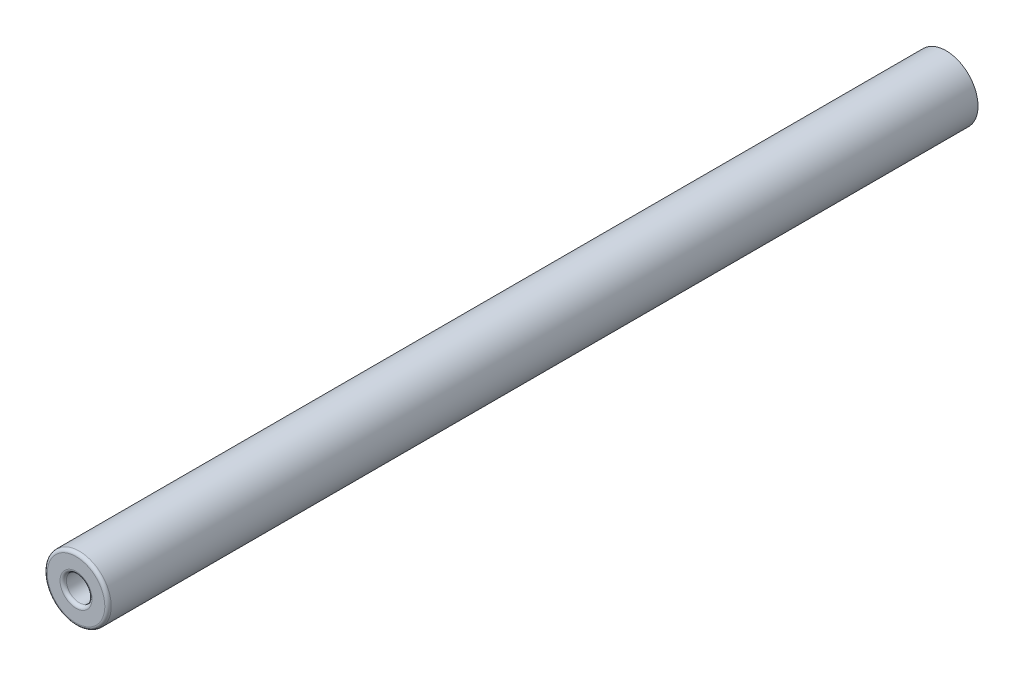
ISO-10303-21;
HEADER;
FILE_DESCRIPTION(('STEP AP214'),'2;1');
FILE_NAME('part.step','',(''),(''),'','','');
FILE_SCHEMA(('AUTOMOTIVE_DESIGN { 1 0 10303 214 1 1 1 1 }'));
ENDSEC;
DATA;
#1=APPLICATION_CONTEXT('core data for automotive mechanical design processes');
#2=APPLICATION_PROTOCOL_DEFINITION('international standard','automotive_design',2000,#1);
#3=PRODUCT_CONTEXT('',#1,'mechanical');
#4=PRODUCT('Part','Part','',(#3));
#5=PRODUCT_RELATED_PRODUCT_CATEGORY('part','',(#4));
#6=PRODUCT_DEFINITION_FORMATION('','',#4);
#7=PRODUCT_DEFINITION_CONTEXT('part definition',#1,'design');
#8=PRODUCT_DEFINITION('design','',#6,#7);
#9=PRODUCT_DEFINITION_SHAPE('','',#8);
#10=(LENGTH_UNIT() NAMED_UNIT(*) SI_UNIT(.MILLI.,.METRE.));
#11=(NAMED_UNIT(*) PLANE_ANGLE_UNIT() SI_UNIT($,.RADIAN.));
#12=(NAMED_UNIT(*) SI_UNIT($,.STERADIAN.) SOLID_ANGLE_UNIT());
#13=UNCERTAINTY_MEASURE_WITH_UNIT(LENGTH_MEASURE(1.E-05),#10,'distance_accuracy_value','');
#14=(GEOMETRIC_REPRESENTATION_CONTEXT(3) GLOBAL_UNCERTAINTY_ASSIGNED_CONTEXT((#13)) GLOBAL_UNIT_ASSIGNED_CONTEXT((#10,
#11,#12)) REPRESENTATION_CONTEXT('',''));
#15=CARTESIAN_POINT('',(0.,0.,0.));
#16=DIRECTION('',(0.,0.,1.));
#17=DIRECTION('',(1.,0.,0.));
#18=AXIS2_PLACEMENT_3D('',#15,#16,#17);
#19=CARTESIAN_POINT('',(0.,0.,34.));
#20=DIRECTION('',(0.,0.,-1.));
#21=DIRECTION('',(-1.,0.,0.));
#22=AXIS2_PLACEMENT_3D('',#19,#20,#21);
#23=CYLINDRICAL_SURFACE('',#22,2.5);
#24=CARTESIAN_POINT('',(0.,0.,33.75));
#25=DIRECTION('',(0.,0.,1.));
#26=DIRECTION('',(1.,0.,0.));
#27=AXIS2_PLACEMENT_3D('',#24,#25,#26);
#28=CIRCLE('',#27,2.5);
#29=CARTESIAN_POINT('',(2.5,0.,33.75));
#30=VERTEX_POINT('',#29);
#31=EDGE_CURVE('E49',#30,#30,#28,.F.);
#32=ORIENTED_EDGE('',*,*,#31,.T.);
#33=EDGE_LOOP('',(#32));
#34=FACE_BOUND('',#33,.T.);
#35=CARTESIAN_POINT('',(0.,0.,-34.));
#36=DIRECTION('',(0.,0.,1.));
#37=DIRECTION('',(1.,0.,0.));
#38=AXIS2_PLACEMENT_3D('',#35,#36,#37);
#39=CIRCLE('',#38,2.5);
#40=CARTESIAN_POINT('',(2.5,0.,-34.));
#41=VERTEX_POINT('',#40);
#42=EDGE_CURVE('E62',#41,#41,#39,.T.);
#43=ORIENTED_EDGE('',*,*,#42,.T.);
#44=EDGE_LOOP('',(#43));
#45=FACE_BOUND('',#44,.T.);
#46=ADVANCED_FACE('F42',(#34,#45),#23,.T.);
#47=CARTESIAN_POINT('',(0.,0.,34.));
#48=DIRECTION('',(0.,0.,1.));
#49=DIRECTION('',(1.,0.,0.));
#50=AXIS2_PLACEMENT_3D('',#47,#48,#49);
#51=PLANE('',#50);
#52=CARTESIAN_POINT('',(0.,0.,34.));
#53=DIRECTION('',(0.,0.,1.));
#54=DIRECTION('',(1.,0.,0.));
#55=AXIS2_PLACEMENT_3D('',#52,#53,#54);
#56=CIRCLE('',#55,2.25);
#57=CARTESIAN_POINT('',(2.25,0.,34.));
#58=VERTEX_POINT('',#57);
#59=EDGE_CURVE('E53',#58,#58,#56,.T.);
#60=ORIENTED_EDGE('',*,*,#59,.T.);
#61=EDGE_LOOP('',(#60));
#62=FACE_BOUND('',#61,.T.);
#63=CARTESIAN_POINT('',(0.,0.,34.));
#64=DIRECTION('',(0.,0.,1.));
#65=DIRECTION('',(1.,0.,0.));
#66=AXIS2_PLACEMENT_3D('',#63,#64,#65);
#67=CIRCLE('',#66,1.25);
#68=CARTESIAN_POINT('',(1.25,0.,34.));
#69=VERTEX_POINT('',#68);
#70=EDGE_CURVE('E57',#69,#69,#67,.F.);
#71=ORIENTED_EDGE('',*,*,#70,.T.);
#72=EDGE_LOOP('',(#71));
#73=FACE_BOUND('',#72,.T.);
#74=ADVANCED_FACE('F81',(#62,#73),#51,.T.);
#75=CARTESIAN_POINT('',(0.,0.,-34.));
#76=DIRECTION('',(0.,0.,1.));
#77=DIRECTION('',(1.,0.,0.));
#78=AXIS2_PLACEMENT_3D('',#75,#76,#77);
#79=PLANE('',#78);
#80=ORIENTED_EDGE('',*,*,#42,.F.);
#81=EDGE_LOOP('',(#80));
#82=FACE_BOUND('',#81,.T.);
#83=ADVANCED_FACE('F73',(#82),#79,.F.);
#84=CARTESIAN_POINT('',(0.,0.,14.));
#85=DIRECTION('',(0.,0.,1.));
#86=DIRECTION('',(1.,0.,0.));
#87=AXIS2_PLACEMENT_3D('',#84,#85,#86);
#88=CYLINDRICAL_SURFACE('',#87,1.);
#89=CARTESIAN_POINT('',(0.,0.,33.75));
#90=DIRECTION('',(0.,0.,1.));
#91=DIRECTION('',(1.,0.,0.));
#92=AXIS2_PLACEMENT_3D('',#89,#90,#91);
#93=CIRCLE('',#92,1.);
#94=CARTESIAN_POINT('',(1.,0.,33.75));
#95=VERTEX_POINT('',#94);
#96=EDGE_CURVE('E12',#95,#95,#93,.T.);
#97=ORIENTED_EDGE('',*,*,#96,.T.);
#98=EDGE_LOOP('',(#97));
#99=FACE_BOUND('',#98,.T.);
#100=CARTESIAN_POINT('',(0.,0.,14.));
#101=DIRECTION('',(0.,0.,1.));
#102=DIRECTION('',(1.,0.,0.));
#103=AXIS2_PLACEMENT_3D('',#100,#101,#102);
#104=CIRCLE('',#103,1.);
#105=CARTESIAN_POINT('',(1.,0.,14.));
#106=VERTEX_POINT('',#105);
#107=EDGE_CURVE('E65',#106,#106,#104,.T.);
#108=ORIENTED_EDGE('',*,*,#107,.F.);
#109=EDGE_LOOP('',(#108));
#110=FACE_BOUND('',#109,.T.);
#111=ADVANCED_FACE('F71',(#99,#110),#88,.F.);
#112=CARTESIAN_POINT('',(0.,0.,14.));
#113=DIRECTION('',(0.,0.,1.));
#114=DIRECTION('',(1.,0.,0.));
#115=AXIS2_PLACEMENT_3D('',#112,#113,#114);
#116=PLANE('',#115);
#117=ORIENTED_EDGE('',*,*,#107,.T.);
#118=EDGE_LOOP('',(#117));
#119=FACE_BOUND('',#118,.T.);
#120=ADVANCED_FACE('F69',(#119),#116,.T.);
#121=CARTESIAN_POINT('',(0.,0.,33.75));
#122=DIRECTION('',(0.,0.,1.));
#123=DIRECTION('',(1.,0.,0.));
#124=AXIS2_PLACEMENT_3D('',#121,#122,#123);
#125=TOROIDAL_SURFACE('',#124,2.25,0.25);
#126=ORIENTED_EDGE('',*,*,#31,.F.);
#127=EDGE_LOOP('',(#126));
#128=FACE_BOUND('',#127,.T.);
#129=ORIENTED_EDGE('',*,*,#59,.F.);
#130=EDGE_LOOP('',(#129));
#131=FACE_BOUND('',#130,.T.);
#132=ADVANCED_FACE('F79',(#128,#131),#125,.T.);
#133=CARTESIAN_POINT('',(0.,0.,33.75));
#134=DIRECTION('',(0.,0.,1.));
#135=DIRECTION('',(1.,0.,0.));
#136=AXIS2_PLACEMENT_3D('',#133,#134,#135);
#137=TOROIDAL_SURFACE('',#136,1.25,0.25);
#138=ORIENTED_EDGE('',*,*,#70,.F.);
#139=EDGE_LOOP('',(#138));
#140=FACE_BOUND('',#139,.T.);
#141=ORIENTED_EDGE('',*,*,#96,.F.);
#142=EDGE_LOOP('',(#141));
#143=FACE_BOUND('',#142,.T.);
#144=ADVANCED_FACE('F44',(#140,#143),#137,.T.);
#145=CLOSED_SHELL('',(#46,#74,#83,#111,#120,#132,#144));
#146=MANIFOLD_SOLID_BREP('B2',#145);
#147=ADVANCED_BREP_SHAPE_REPRESENTATION('',(#18,#146),#14);
#148=SHAPE_DEFINITION_REPRESENTATION(#9,#147);
ENDSEC;
END-ISO-10303-21;
